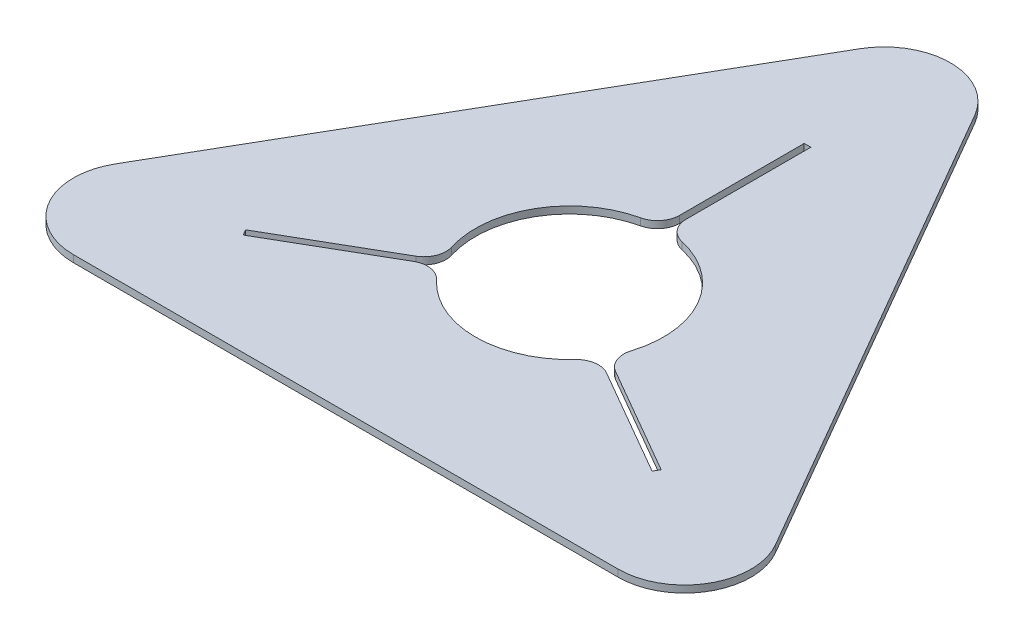
ISO-10303-21;
HEADER;
FILE_DESCRIPTION(('STEP AP214'),'2;1');
FILE_NAME('part.step','',(''),(''),'','','');
FILE_SCHEMA(('AUTOMOTIVE_DESIGN { 1 0 10303 214 1 1 1 1 }'));
ENDSEC;
DATA;
#1=APPLICATION_CONTEXT('core data for automotive mechanical design processes');
#2=APPLICATION_PROTOCOL_DEFINITION('international standard','automotive_design',2000,#1);
#3=PRODUCT_CONTEXT('',#1,'mechanical');
#4=PRODUCT('Part','Part','',(#3));
#5=PRODUCT_RELATED_PRODUCT_CATEGORY('part','',(#4));
#6=PRODUCT_DEFINITION_FORMATION('','',#4);
#7=PRODUCT_DEFINITION_CONTEXT('part definition',#1,'design');
#8=PRODUCT_DEFINITION('design','',#6,#7);
#9=PRODUCT_DEFINITION_SHAPE('','',#8);
#10=(LENGTH_UNIT() NAMED_UNIT(*) SI_UNIT(.MILLI.,.METRE.));
#11=(NAMED_UNIT(*) PLANE_ANGLE_UNIT() SI_UNIT($,.RADIAN.));
#12=(NAMED_UNIT(*) SI_UNIT($,.STERADIAN.) SOLID_ANGLE_UNIT());
#13=UNCERTAINTY_MEASURE_WITH_UNIT(LENGTH_MEASURE(1.E-05),#10,'distance_accuracy_value','');
#14=(GEOMETRIC_REPRESENTATION_CONTEXT(3) GLOBAL_UNCERTAINTY_ASSIGNED_CONTEXT((#13)) GLOBAL_UNIT_ASSIGNED_CONTEXT((#10,
#11,#12)) REPRESENTATION_CONTEXT('',''));
#15=CARTESIAN_POINT('',(0.,0.,0.));
#16=DIRECTION('',(0.,0.,1.));
#17=DIRECTION('',(1.,0.,0.));
#18=AXIS2_PLACEMENT_3D('',#15,#16,#17);
#19=CARTESIAN_POINT('',(0.,0.,404.145188432738));
#20=DIRECTION('',(0.,1.,0.));
#21=DIRECTION('',(0.,0.,1.));
#22=AXIS2_PLACEMENT_3D('',#19,#20,#21);
#23=CYLINDRICAL_SURFACE('',#22,85.);
#24=CARTESIAN_POINT('',(0.,6.35,404.145188432738));
#25=DIRECTION('',(0.,1.,0.));
#26=DIRECTION('',(0.,0.,1.));
#27=AXIS2_PLACEMENT_3D('',#24,#25,#26);
#28=CIRCLE('',#27,85.);
#29=CARTESIAN_POINT('',(81.1339507081753,6.35,429.488472404697));
#30=VERTEX_POINT('',#29);
#31=CARTESIAN_POINT('',(18.6190476190476,6.35,321.209484024084));
#32=VERTEX_POINT('',#31);
#33=EDGE_CURVE('E263',#30,#32,#28,.T.);
#34=ORIENTED_EDGE('',*,*,#33,.T.);
#35=DIRECTION('',(0.,1.,0.));
#36=VECTOR('',#35,1.);
#37=CARTESIAN_POINT('',(18.6190476190476,0.,321.209484024084));
#38=LINE('',#37,#36);
#39=CARTESIAN_POINT('',(18.6190476190476,0.,321.209484024084));
#40=VERTEX_POINT('',#39);
#41=EDGE_CURVE('E353',#32,#40,#38,.F.);
#42=ORIENTED_EDGE('',*,*,#41,.T.);
#43=CARTESIAN_POINT('',(0.,0.,404.145188432738));
#44=DIRECTION('',(0.,1.,0.));
#45=DIRECTION('',(0.,0.,1.));
#46=AXIS2_PLACEMENT_3D('',#43,#44,#45);
#47=CIRCLE('',#46,85.);
#48=CARTESIAN_POINT('',(81.1339507081753,0.,429.488472404697));
#49=VERTEX_POINT('',#48);
#50=EDGE_CURVE('E269',#49,#40,#47,.T.);
#51=ORIENTED_EDGE('',*,*,#50,.F.);
#52=DIRECTION('',(0.,1.,0.));
#53=VECTOR('',#52,1.);
#54=CARTESIAN_POINT('',(81.1339507081753,0.,429.488472404697));
#55=LINE('',#54,#53);
#56=EDGE_CURVE('E350',#49,#30,#55,.T.);
#57=ORIENTED_EDGE('',*,*,#56,.T.);
#58=EDGE_LOOP('',(#34,#42,#51,#57));
#59=FACE_BOUND('',#58,.T.);
#60=ADVANCED_FACE('F33',(#59),#23,.F.);
#61=CARTESIAN_POINT('',(-62.5149030891276,6.35,461.737608869432));
#62=VERTEX_POINT('',#61);
#63=CARTESIAN_POINT('',(62.5149030891277,6.35,461.737608869432));
#64=VERTEX_POINT('',#63);
#65=EDGE_CURVE('E272',#62,#64,#28,.T.);
#66=ORIENTED_EDGE('',*,*,#65,.T.);
#67=DIRECTION('',(0.,1.,0.));
#68=VECTOR('',#67,1.);
#69=CARTESIAN_POINT('',(62.5149030891277,0.,461.737608869432));
#70=LINE('',#69,#68);
#71=CARTESIAN_POINT('',(62.5149030891277,0.,461.737608869432));
#72=VERTEX_POINT('',#71);
#73=EDGE_CURVE('E363',#64,#72,#70,.F.);
#74=ORIENTED_EDGE('',*,*,#73,.T.);
#75=CARTESIAN_POINT('',(-62.5149030891276,0.,461.737608869432));
#76=VERTEX_POINT('',#75);
#77=EDGE_CURVE('E266',#76,#72,#47,.T.);
#78=ORIENTED_EDGE('',*,*,#77,.F.);
#79=DIRECTION('',(0.,1.,0.));
#80=VECTOR('',#79,1.);
#81=CARTESIAN_POINT('',(-62.5149030891276,0.,461.737608869432));
#82=LINE('',#81,#80);
#83=EDGE_CURVE('E360',#76,#62,#82,.T.);
#84=ORIENTED_EDGE('',*,*,#83,.T.);
#85=EDGE_LOOP('',(#66,#74,#78,#84));
#86=FACE_BOUND('',#85,.T.);
#87=ADVANCED_FACE('F380',(#86),#23,.F.);
#88=CARTESIAN_POINT('',(350.,6.35,606.217782649107));
#89=DIRECTION('',(-0.866025403784439,0.,0.5));
#90=DIRECTION('',(0.5,0.,0.866025403784439));
#91=AXIS2_PLACEMENT_3D('',#88,#89,#90);
#92=PLANE('',#91);
#93=DIRECTION('',(-0.5,0.,-0.866025403784439));
#94=VECTOR('',#93,1.);
#95=CARTESIAN_POINT('',(350.,0.,606.217782649107));
#96=LINE('',#95,#94);
#97=CARTESIAN_POINT('',(298.038475772933,0.,516.217782649107));
#98=VERTEX_POINT('',#97);
#99=CARTESIAN_POINT('',(51.9615242270664,0.,90.0000000000002));
#100=VERTEX_POINT('',#99);
#101=EDGE_CURVE('E285',#98,#100,#96,.T.);
#102=ORIENTED_EDGE('',*,*,#101,.T.);
#103=DIRECTION('',(0.,-1.,0.));
#104=VECTOR('',#103,1.);
#105=CARTESIAN_POINT('',(51.9615242270663,6.35,90.));
#106=LINE('',#105,#104);
#107=CARTESIAN_POINT('',(51.9615242270664,6.35,90.0000000000002));
#108=VERTEX_POINT('',#107);
#109=EDGE_CURVE('E306',#100,#108,#106,.F.);
#110=ORIENTED_EDGE('',*,*,#109,.T.);
#111=DIRECTION('',(-0.5,0.,-0.866025403784439));
#112=VECTOR('',#111,1.);
#113=CARTESIAN_POINT('',(350.,6.35,606.217782649107));
#114=LINE('',#113,#112);
#115=CARTESIAN_POINT('',(298.038475772933,6.35,516.217782649107));
#116=VERTEX_POINT('',#115);
#117=EDGE_CURVE('E274',#116,#108,#114,.T.);
#118=ORIENTED_EDGE('',*,*,#117,.F.);
#119=DIRECTION('',(0.,-1.,0.));
#120=VECTOR('',#119,1.);
#121=CARTESIAN_POINT('',(298.038475772933,6.35,516.217782649107));
#122=LINE('',#121,#120);
#123=EDGE_CURVE('E303',#116,#98,#122,.T.);
#124=ORIENTED_EDGE('',*,*,#123,.T.);
#125=EDGE_LOOP('',(#102,#110,#118,#124));
#126=FACE_BOUND('',#125,.T.);
#127=ADVANCED_FACE('F440',(#126),#92,.F.);
#128=CARTESIAN_POINT('',(0.,6.35,0.));
#129=DIRECTION('',(0.866025403784439,0.,0.5));
#130=DIRECTION('',(0.5,0.,-0.866025403784439));
#131=AXIS2_PLACEMENT_3D('',#128,#129,#130);
#132=PLANE('',#131);
#133=DIRECTION('',(-0.5,0.,0.866025403784439));
#134=VECTOR('',#133,1.);
#135=CARTESIAN_POINT('',(0.,6.35,0.));
#136=LINE('',#135,#134);
#137=CARTESIAN_POINT('',(-51.9615242270663,6.35,90.));
#138=VERTEX_POINT('',#137);
#139=CARTESIAN_POINT('',(-298.038475772934,6.35,516.217782649107));
#140=VERTEX_POINT('',#139);
#141=EDGE_CURVE('E277',#138,#140,#136,.T.);
#142=ORIENTED_EDGE('',*,*,#141,.F.);
#143=DIRECTION('',(0.,-1.,0.));
#144=VECTOR('',#143,1.);
#145=CARTESIAN_POINT('',(-51.9615242270663,6.35,90.));
#146=LINE('',#145,#144);
#147=CARTESIAN_POINT('',(-51.9615242270663,0.,90.));
#148=VERTEX_POINT('',#147);
#149=EDGE_CURVE('E294',#138,#148,#146,.T.);
#150=ORIENTED_EDGE('',*,*,#149,.T.);
#151=DIRECTION('',(-0.5,0.,0.866025403784439));
#152=VECTOR('',#151,1.);
#153=CARTESIAN_POINT('',(0.,0.,0.));
#154=LINE('',#153,#152);
#155=CARTESIAN_POINT('',(-298.038475772934,0.,516.217782649107));
#156=VERTEX_POINT('',#155);
#157=EDGE_CURVE('E288',#148,#156,#154,.T.);
#158=ORIENTED_EDGE('',*,*,#157,.T.);
#159=DIRECTION('',(0.,-1.,0.));
#160=VECTOR('',#159,1.);
#161=CARTESIAN_POINT('',(-298.038475772934,6.35,516.217782649107));
#162=LINE('',#161,#160);
#163=EDGE_CURVE('E284',#156,#140,#162,.F.);
#164=ORIENTED_EDGE('',*,*,#163,.T.);
#165=EDGE_LOOP('',(#142,#150,#158,#164));
#166=FACE_BOUND('',#165,.T.);
#167=ADVANCED_FACE('F460',(#166),#132,.F.);
#168=CARTESIAN_POINT('',(-350.,6.35,606.217782649107));
#169=DIRECTION('',(0.,0.,-1.));
#170=DIRECTION('',(-1.,0.,0.));
#171=AXIS2_PLACEMENT_3D('',#168,#169,#170);
#172=PLANE('',#171);
#173=DIRECTION('',(1.,0.,0.));
#174=VECTOR('',#173,1.);
#175=CARTESIAN_POINT('',(-350.,0.,606.217782649107));
#176=LINE('',#175,#174);
#177=CARTESIAN_POINT('',(-246.076951545867,0.,606.217782649107));
#178=VERTEX_POINT('',#177);
#179=CARTESIAN_POINT('',(246.076951545867,0.,606.217782649107));
#180=VERTEX_POINT('',#179);
#181=EDGE_CURVE('E278',#178,#180,#176,.T.);
#182=ORIENTED_EDGE('',*,*,#181,.T.);
#183=DIRECTION('',(0.,-1.,0.));
#184=VECTOR('',#183,1.);
#185=CARTESIAN_POINT('',(246.076951545867,6.35,606.217782649107));
#186=LINE('',#185,#184);
#187=CARTESIAN_POINT('',(246.076951545867,6.35,606.217782649107));
#188=VERTEX_POINT('',#187);
#189=EDGE_CURVE('E317',#180,#188,#186,.F.);
#190=ORIENTED_EDGE('',*,*,#189,.T.);
#191=DIRECTION('',(1.,0.,0.));
#192=VECTOR('',#191,1.);
#193=CARTESIAN_POINT('',(-350.,6.35,606.217782649107));
#194=LINE('',#193,#192);
#195=CARTESIAN_POINT('',(-246.076951545867,6.35,606.217782649107));
#196=VERTEX_POINT('',#195);
#197=EDGE_CURVE('E281',#196,#188,#194,.T.);
#198=ORIENTED_EDGE('',*,*,#197,.F.);
#199=DIRECTION('',(0.,-1.,0.));
#200=VECTOR('',#199,1.);
#201=CARTESIAN_POINT('',(-246.076951545867,6.35,606.217782649107));
#202=LINE('',#201,#200);
#203=EDGE_CURVE('E314',#196,#178,#202,.T.);
#204=ORIENTED_EDGE('',*,*,#203,.T.);
#205=EDGE_LOOP('',(#182,#190,#198,#204));
#206=FACE_BOUND('',#205,.T.);
#207=ADVANCED_FACE('F456',(#206),#172,.F.);
#208=CARTESIAN_POINT('',(0.,6.35,0.));
#209=DIRECTION('',(0.,1.,0.));
#210=DIRECTION('',(0.,0.,1.));
#211=AXIS2_PLACEMENT_3D('',#208,#209,#210);
#212=PLANE('',#211);
#213=CARTESIAN_POINT('',(-18.6190476190476,6.35,321.209484024084));
#214=VERTEX_POINT('',#213);
#215=CARTESIAN_POINT('',(-81.1339507081752,6.35,429.488472404698));
#216=VERTEX_POINT('',#215);
#217=EDGE_CURVE('E273',#214,#216,#28,.T.);
#218=ORIENTED_EDGE('',*,*,#217,.F.);
#219=CARTESIAN_POINT('',(-23.,6.35,301.695200633812));
#220=DIRECTION('',(0.,1.,0.));
#221=DIRECTION('',(0.,0.,1.));
#222=AXIS2_PLACEMENT_3D('',#219,#220,#221);
#223=CIRCLE('',#222,20.);
#224=CARTESIAN_POINT('',(-3.00000000000003,6.35,301.695200633812));
#225=VERTEX_POINT('',#224);
#226=EDGE_CURVE('E335',#214,#225,#223,.T.);
#227=ORIENTED_EDGE('',*,*,#226,.T.);
#228=DIRECTION('',(0.,0.,1.));
#229=VECTOR('',#228,1.);
#230=CARTESIAN_POINT('',(-3.00000000000003,6.35,374.145188432738));
#231=LINE('',#230,#229);
#232=CARTESIAN_POINT('',(-3.00000000000003,6.35,189.145188432738));
#233=VERTEX_POINT('',#232);
#234=EDGE_CURVE('E224',#233,#225,#231,.T.);
#235=ORIENTED_EDGE('',*,*,#234,.F.);
#236=DIRECTION('',(-1.,0.,0.));
#237=VECTOR('',#236,1.);
#238=CARTESIAN_POINT('',(-3.00000000000003,6.35,189.145188432738));
#239=LINE('',#238,#237);
#240=CARTESIAN_POINT('',(2.99999999999997,6.35,189.145188432738));
#241=VERTEX_POINT('',#240);
#242=EDGE_CURVE('E249',#241,#233,#239,.T.);
#243=ORIENTED_EDGE('',*,*,#242,.F.);
#244=DIRECTION('',(0.,0.,-1.));
#245=VECTOR('',#244,1.);
#246=CARTESIAN_POINT('',(3.00000000000002,6.35,374.145188432738));
#247=LINE('',#246,#245);
#248=CARTESIAN_POINT('',(3.,6.35,301.695200633812));
#249=VERTEX_POINT('',#248);
#250=EDGE_CURVE('E257',#249,#241,#247,.T.);
#251=ORIENTED_EDGE('',*,*,#250,.F.);
#252=CARTESIAN_POINT('',(23.,6.35,301.695200633812));
#253=DIRECTION('',(0.,1.,0.));
#254=DIRECTION('',(0.,0.,1.));
#255=AXIS2_PLACEMENT_3D('',#252,#253,#254);
#256=CIRCLE('',#255,20.);
#257=EDGE_CURVE('E333',#249,#32,#256,.T.);
#258=ORIENTED_EDGE('',*,*,#257,.T.);
#259=ORIENTED_EDGE('',*,*,#33,.F.);
#260=CARTESIAN_POINT('',(100.224292051275,6.35,435.451598045158));
#261=DIRECTION('',(0.,1.,0.));
#262=DIRECTION('',(0.,0.,1.));
#263=AXIS2_PLACEMENT_3D('',#260,#261,#262);
#264=CIRCLE('',#263,20.);
#265=CARTESIAN_POINT('',(90.2242920512754,6.35,452.772106120847));
#266=VERTEX_POINT('',#265);
#267=EDGE_CURVE('E331',#30,#266,#264,.T.);
#268=ORIENTED_EDGE('',*,*,#267,.T.);
#269=DIRECTION('',(-0.866025403784439,0.,-0.5));
#270=VECTOR('',#269,1.);
#271=CARTESIAN_POINT('',(27.4807621135332,6.35,416.547112221384));
#272=LINE('',#271,#270);
#273=CARTESIAN_POINT('',(187.695461813654,6.35,509.047112221384));
#274=VERTEX_POINT('',#273);
#275=EDGE_CURVE('E217',#274,#266,#272,.T.);
#276=ORIENTED_EDGE('',*,*,#275,.F.);
#277=DIRECTION('',(0.499999999999995,0.,-0.866025403784442));
#278=VECTOR('',#277,1.);
#279=CARTESIAN_POINT('',(187.695461813654,6.35,509.047112221384));
#280=LINE('',#279,#278);
#281=CARTESIAN_POINT('',(184.695461813654,6.35,514.243264644091));
#282=VERTEX_POINT('',#281);
#283=EDGE_CURVE('E222',#282,#274,#280,.T.);
#284=ORIENTED_EDGE('',*,*,#283,.F.);
#285=DIRECTION('',(0.866025403784439,0.,0.5));
#286=VECTOR('',#285,1.);
#287=CARTESIAN_POINT('',(24.4807621135332,6.35,421.743264644091));
#288=LINE('',#287,#286);
#289=CARTESIAN_POINT('',(87.2242920512754,6.35,457.968258543554));
#290=VERTEX_POINT('',#289);
#291=EDGE_CURVE('E206',#290,#282,#288,.T.);
#292=ORIENTED_EDGE('',*,*,#291,.F.);
#293=CARTESIAN_POINT('',(77.2242920512754,6.35,475.288766619243));
#294=DIRECTION('',(0.,1.,0.));
#295=DIRECTION('',(0.,0.,1.));
#296=AXIS2_PLACEMENT_3D('',#293,#294,#295);
#297=CIRCLE('',#296,20.);
#298=EDGE_CURVE('E329',#290,#64,#297,.T.);
#299=ORIENTED_EDGE('',*,*,#298,.T.);
#300=ORIENTED_EDGE('',*,*,#65,.F.);
#301=CARTESIAN_POINT('',(-77.2242920512753,6.35,475.288766619243));
#302=DIRECTION('',(0.,1.,0.));
#303=DIRECTION('',(0.,0.,1.));
#304=AXIS2_PLACEMENT_3D('',#301,#302,#303);
#305=CIRCLE('',#304,20.);
#306=CARTESIAN_POINT('',(-87.2242920512753,6.35,457.968258543554));
#307=VERTEX_POINT('',#306);
#308=EDGE_CURVE('E327',#62,#307,#305,.T.);
#309=ORIENTED_EDGE('',*,*,#308,.T.);
#310=DIRECTION('',(0.866025403784438,0.,-0.500000000000001));
#311=VECTOR('',#310,1.);
#312=CARTESIAN_POINT('',(-24.4807621135332,6.35,421.743264644091));
#313=LINE('',#312,#311);
#314=CARTESIAN_POINT('',(-184.695461813654,6.35,514.243264644091));
#315=VERTEX_POINT('',#314);
#316=EDGE_CURVE('E236',#315,#307,#313,.T.);
#317=ORIENTED_EDGE('',*,*,#316,.F.);
#318=DIRECTION('',(0.499999999999998,0.,0.866025403784439));
#319=VECTOR('',#318,1.);
#320=CARTESIAN_POINT('',(-184.695461813654,6.35,514.243264644091));
#321=LINE('',#320,#319);
#322=CARTESIAN_POINT('',(-187.695461813654,6.35,509.047112221385));
#323=VERTEX_POINT('',#322);
#324=EDGE_CURVE('E230',#323,#315,#321,.T.);
#325=ORIENTED_EDGE('',*,*,#324,.F.);
#326=DIRECTION('',(-0.866025403784438,0.,0.500000000000001));
#327=VECTOR('',#326,1.);
#328=CARTESIAN_POINT('',(-27.4807621135332,6.35,416.547112221385));
#329=LINE('',#328,#327);
#330=CARTESIAN_POINT('',(-90.2242920512753,6.35,452.772106120847));
#331=VERTEX_POINT('',#330);
#332=EDGE_CURVE('E239',#331,#323,#329,.T.);
#333=ORIENTED_EDGE('',*,*,#332,.F.);
#334=CARTESIAN_POINT('',(-100.224292051275,6.35,435.451598045159));
#335=DIRECTION('',(0.,1.,0.));
#336=DIRECTION('',(0.,0.,1.));
#337=AXIS2_PLACEMENT_3D('',#334,#335,#336);
#338=CIRCLE('',#337,20.);
#339=EDGE_CURVE('E325',#331,#216,#338,.T.);
#340=ORIENTED_EDGE('',*,*,#339,.T.);
#341=EDGE_LOOP('',(#218,#227,#235,#243,#251,#258,#259,#268,#276,#284,#292,#299,#300,#309,#317,
#325,#333,#340));
#342=FACE_BOUND('',#341,.T.);
#343=ORIENTED_EDGE('',*,*,#117,.T.);
#344=CARTESIAN_POINT('',(0.,6.35,120.));
#345=DIRECTION('',(0.,1.,0.));
#346=DIRECTION('',(0.,0.,1.));
#347=AXIS2_PLACEMENT_3D('',#344,#345,#346);
#348=CIRCLE('',#347,60.);
#349=EDGE_CURVE('E312',#108,#138,#348,.T.);
#350=ORIENTED_EDGE('',*,*,#349,.T.);
#351=ORIENTED_EDGE('',*,*,#141,.T.);
#352=CARTESIAN_POINT('',(-246.076951545867,6.35,546.217782649107));
#353=DIRECTION('',(0.,1.,0.));
#354=DIRECTION('',(0.,0.,1.));
#355=AXIS2_PLACEMENT_3D('',#352,#353,#354);
#356=CIRCLE('',#355,60.);
#357=EDGE_CURVE('E308',#140,#196,#356,.T.);
#358=ORIENTED_EDGE('',*,*,#357,.T.);
#359=ORIENTED_EDGE('',*,*,#197,.T.);
#360=CARTESIAN_POINT('',(246.076951545867,6.35,546.217782649107));
#361=DIRECTION('',(0.,1.,0.));
#362=DIRECTION('',(0.,0.,1.));
#363=AXIS2_PLACEMENT_3D('',#360,#361,#362);
#364=CIRCLE('',#363,60.);
#365=EDGE_CURVE('E310',#188,#116,#364,.T.);
#366=ORIENTED_EDGE('',*,*,#365,.T.);
#367=EDGE_LOOP('',(#343,#350,#351,#358,#359,#366));
#368=FACE_BOUND('',#367,.T.);
#369=ADVANCED_FACE('F383',(#342,#368),#212,.T.);
#370=CARTESIAN_POINT('',(0.,0.,0.));
#371=DIRECTION('',(0.,1.,0.));
#372=DIRECTION('',(0.,0.,1.));
#373=AXIS2_PLACEMENT_3D('',#370,#371,#372);
#374=PLANE('',#373);
#375=DIRECTION('',(0.,0.,1.));
#376=VECTOR('',#375,1.);
#377=CARTESIAN_POINT('',(-3.00000000000003,0.,374.145188432738));
#378=LINE('',#377,#376);
#379=CARTESIAN_POINT('',(-3.00000000000003,0.,189.145188432738));
#380=VERTEX_POINT('',#379);
#381=CARTESIAN_POINT('',(-3.00000000000003,0.,301.695200633812));
#382=VERTEX_POINT('',#381);
#383=EDGE_CURVE('E246',#380,#382,#378,.T.);
#384=ORIENTED_EDGE('',*,*,#383,.T.);
#385=CARTESIAN_POINT('',(-23.,0.,301.695200633812));
#386=DIRECTION('',(0.,1.,0.));
#387=DIRECTION('',(0.,0.,1.));
#388=AXIS2_PLACEMENT_3D('',#385,#386,#387);
#389=CIRCLE('',#388,20.);
#390=CARTESIAN_POINT('',(-18.6190476190476,0.,321.209484024084));
#391=VERTEX_POINT('',#390);
#392=EDGE_CURVE('E348',#382,#391,#389,.F.);
#393=ORIENTED_EDGE('',*,*,#392,.T.);
#394=CARTESIAN_POINT('',(-81.1339507081752,0.,429.488472404698));
#395=VERTEX_POINT('',#394);
#396=EDGE_CURVE('E268',#391,#395,#47,.T.);
#397=ORIENTED_EDGE('',*,*,#396,.T.);
#398=CARTESIAN_POINT('',(-100.224292051275,0.,435.451598045159));
#399=DIRECTION('',(0.,1.,0.));
#400=DIRECTION('',(0.,0.,1.));
#401=AXIS2_PLACEMENT_3D('',#398,#399,#400);
#402=CIRCLE('',#401,20.);
#403=CARTESIAN_POINT('',(-90.2242920512753,0.,452.772106120847));
#404=VERTEX_POINT('',#403);
#405=EDGE_CURVE('E339',#395,#404,#402,.F.);
#406=ORIENTED_EDGE('',*,*,#405,.T.);
#407=DIRECTION('',(-0.866025403784438,0.,0.500000000000001));
#408=VECTOR('',#407,1.);
#409=CARTESIAN_POINT('',(-27.4807621135332,0.,416.547112221385));
#410=LINE('',#409,#408);
#411=CARTESIAN_POINT('',(-187.695461813654,0.,509.047112221385));
#412=VERTEX_POINT('',#411);
#413=EDGE_CURVE('E229',#404,#412,#410,.T.);
#414=ORIENTED_EDGE('',*,*,#413,.T.);
#415=DIRECTION('',(0.499999999999998,0.,0.866025403784439));
#416=VECTOR('',#415,1.);
#417=CARTESIAN_POINT('',(-184.695461813654,0.,514.243264644091));
#418=LINE('',#417,#416);
#419=CARTESIAN_POINT('',(-184.695461813654,0.,514.243264644091));
#420=VERTEX_POINT('',#419);
#421=EDGE_CURVE('E232',#412,#420,#418,.T.);
#422=ORIENTED_EDGE('',*,*,#421,.T.);
#423=DIRECTION('',(0.866025403784438,0.,-0.500000000000001));
#424=VECTOR('',#423,1.);
#425=CARTESIAN_POINT('',(-24.4807621135332,0.,421.743264644091));
#426=LINE('',#425,#424);
#427=CARTESIAN_POINT('',(-87.2242920512753,0.,457.968258543554));
#428=VERTEX_POINT('',#427);
#429=EDGE_CURVE('E226',#420,#428,#426,.T.);
#430=ORIENTED_EDGE('',*,*,#429,.T.);
#431=CARTESIAN_POINT('',(-77.2242920512753,0.,475.288766619243));
#432=DIRECTION('',(0.,1.,0.));
#433=DIRECTION('',(0.,0.,1.));
#434=AXIS2_PLACEMENT_3D('',#431,#432,#433);
#435=CIRCLE('',#434,20.);
#436=EDGE_CURVE('E341',#428,#76,#435,.F.);
#437=ORIENTED_EDGE('',*,*,#436,.T.);
#438=ORIENTED_EDGE('',*,*,#77,.T.);
#439=CARTESIAN_POINT('',(77.2242920512754,0.,475.288766619243));
#440=DIRECTION('',(0.,1.,0.));
#441=DIRECTION('',(0.,0.,1.));
#442=AXIS2_PLACEMENT_3D('',#439,#440,#441);
#443=CIRCLE('',#442,20.);
#444=CARTESIAN_POINT('',(87.2242920512754,0.,457.968258543554));
#445=VERTEX_POINT('',#444);
#446=EDGE_CURVE('E48',#72,#445,#443,.F.);
#447=ORIENTED_EDGE('',*,*,#446,.T.);
#448=DIRECTION('',(0.866025403784439,0.,0.5));
#449=VECTOR('',#448,1.);
#450=CARTESIAN_POINT('',(24.4807621135332,0.,421.743264644091));
#451=LINE('',#450,#449);
#452=CARTESIAN_POINT('',(184.695461813654,0.,514.243264644091));
#453=VERTEX_POINT('',#452);
#454=EDGE_CURVE('E191',#445,#453,#451,.T.);
#455=ORIENTED_EDGE('',*,*,#454,.T.);
#456=DIRECTION('',(0.499999999999995,0.,-0.866025403784442));
#457=VECTOR('',#456,1.);
#458=CARTESIAN_POINT('',(187.695461813654,0.,509.047112221384));
#459=LINE('',#458,#457);
#460=CARTESIAN_POINT('',(187.695461813654,0.,509.047112221384));
#461=VERTEX_POINT('',#460);
#462=EDGE_CURVE('E198',#453,#461,#459,.T.);
#463=ORIENTED_EDGE('',*,*,#462,.T.);
#464=DIRECTION('',(-0.866025403784439,0.,-0.5));
#465=VECTOR('',#464,1.);
#466=CARTESIAN_POINT('',(27.4807621135332,0.,416.547112221384));
#467=LINE('',#466,#465);
#468=CARTESIAN_POINT('',(90.2242920512754,0.,452.772106120847));
#469=VERTEX_POINT('',#468);
#470=EDGE_CURVE('E200',#461,#469,#467,.T.);
#471=ORIENTED_EDGE('',*,*,#470,.T.);
#472=CARTESIAN_POINT('',(100.224292051275,0.,435.451598045158));
#473=DIRECTION('',(0.,1.,0.));
#474=DIRECTION('',(0.,0.,1.));
#475=AXIS2_PLACEMENT_3D('',#472,#473,#474);
#476=CIRCLE('',#475,20.);
#477=EDGE_CURVE('E344',#469,#49,#476,.F.);
#478=ORIENTED_EDGE('',*,*,#477,.T.);
#479=ORIENTED_EDGE('',*,*,#50,.T.);
#480=CARTESIAN_POINT('',(23.,0.,301.695200633812));
#481=DIRECTION('',(0.,1.,0.));
#482=DIRECTION('',(0.,0.,1.));
#483=AXIS2_PLACEMENT_3D('',#480,#481,#482);
#484=CIRCLE('',#483,20.);
#485=CARTESIAN_POINT('',(3.,0.,301.695200633812));
#486=VERTEX_POINT('',#485);
#487=EDGE_CURVE('E346',#40,#486,#484,.F.);
#488=ORIENTED_EDGE('',*,*,#487,.T.);
#489=DIRECTION('',(0.,0.,-1.));
#490=VECTOR('',#489,1.);
#491=CARTESIAN_POINT('',(3.00000000000002,0.,374.145188432738));
#492=LINE('',#491,#490);
#493=CARTESIAN_POINT('',(2.99999999999997,0.,189.145188432738));
#494=VERTEX_POINT('',#493);
#495=EDGE_CURVE('E248',#486,#494,#492,.T.);
#496=ORIENTED_EDGE('',*,*,#495,.T.);
#497=DIRECTION('',(-1.,0.,0.));
#498=VECTOR('',#497,1.);
#499=CARTESIAN_POINT('',(-3.00000000000003,0.,189.145188432738));
#500=LINE('',#499,#498);
#501=EDGE_CURVE('E251',#494,#380,#500,.T.);
#502=ORIENTED_EDGE('',*,*,#501,.T.);
#503=EDGE_LOOP('',(#384,#393,#397,#406,#414,#422,#430,#437,#438,#447,#455,#463,#471,#478,#479,
#488,#496,#502));
#504=FACE_BOUND('',#503,.T.);
#505=ORIENTED_EDGE('',*,*,#157,.F.);
#506=CARTESIAN_POINT('',(0.,0.,120.));
#507=DIRECTION('',(0.,1.,0.));
#508=DIRECTION('',(0.,0.,1.));
#509=AXIS2_PLACEMENT_3D('',#506,#507,#508);
#510=CIRCLE('',#509,60.);
#511=EDGE_CURVE('E301',#148,#100,#510,.F.);
#512=ORIENTED_EDGE('',*,*,#511,.T.);
#513=ORIENTED_EDGE('',*,*,#101,.F.);
#514=CARTESIAN_POINT('',(246.076951545867,0.,546.217782649107));
#515=DIRECTION('',(0.,1.,0.));
#516=DIRECTION('',(0.,0.,1.));
#517=AXIS2_PLACEMENT_3D('',#514,#515,#516);
#518=CIRCLE('',#517,60.);
#519=EDGE_CURVE('E299',#98,#180,#518,.F.);
#520=ORIENTED_EDGE('',*,*,#519,.T.);
#521=ORIENTED_EDGE('',*,*,#181,.F.);
#522=CARTESIAN_POINT('',(-246.076951545867,0.,546.217782649107));
#523=DIRECTION('',(0.,1.,0.));
#524=DIRECTION('',(0.,0.,1.));
#525=AXIS2_PLACEMENT_3D('',#522,#523,#524);
#526=CIRCLE('',#525,60.);
#527=EDGE_CURVE('E297',#178,#156,#526,.F.);
#528=ORIENTED_EDGE('',*,*,#527,.T.);
#529=EDGE_LOOP('',(#505,#512,#513,#520,#521,#528));
#530=FACE_BOUND('',#529,.T.);
#531=ADVANCED_FACE('F194',(#504,#530),#374,.F.);
#532=ORIENTED_EDGE('',*,*,#396,.F.);
#533=DIRECTION('',(0.,1.,0.));
#534=VECTOR('',#533,1.);
#535=CARTESIAN_POINT('',(-18.6190476190476,0.,321.209484024084));
#536=LINE('',#535,#534);
#537=EDGE_CURVE('E322',#391,#214,#536,.T.);
#538=ORIENTED_EDGE('',*,*,#537,.T.);
#539=ORIENTED_EDGE('',*,*,#217,.T.);
#540=DIRECTION('',(0.,1.,0.));
#541=VECTOR('',#540,1.);
#542=CARTESIAN_POINT('',(-81.1339507081753,0.,429.488472404698));
#543=LINE('',#542,#541);
#544=EDGE_CURVE('E319',#216,#395,#543,.F.);
#545=ORIENTED_EDGE('',*,*,#544,.T.);
#546=EDGE_LOOP('',(#532,#538,#539,#545));
#547=FACE_BOUND('',#546,.T.);
#548=ADVANCED_FACE('F396',(#547),#23,.F.);
#549=CARTESIAN_POINT('',(0.,6.35,120.));
#550=DIRECTION('',(0.,-1.,0.));
#551=DIRECTION('',(0.,0.,-1.));
#552=AXIS2_PLACEMENT_3D('',#549,#550,#551);
#553=CYLINDRICAL_SURFACE('',#552,60.);
#554=ORIENTED_EDGE('',*,*,#349,.F.);
#555=ORIENTED_EDGE('',*,*,#109,.F.);
#556=ORIENTED_EDGE('',*,*,#511,.F.);
#557=ORIENTED_EDGE('',*,*,#149,.F.);
#558=EDGE_LOOP('',(#554,#555,#556,#557));
#559=FACE_BOUND('',#558,.T.);
#560=ADVANCED_FACE('F444',(#559),#553,.T.);
#561=CARTESIAN_POINT('',(246.076951545867,6.35,546.217782649107));
#562=DIRECTION('',(0.,-1.,0.));
#563=DIRECTION('',(0.,0.,-1.));
#564=AXIS2_PLACEMENT_3D('',#561,#562,#563);
#565=CYLINDRICAL_SURFACE('',#564,60.);
#566=ORIENTED_EDGE('',*,*,#365,.F.);
#567=ORIENTED_EDGE('',*,*,#189,.F.);
#568=ORIENTED_EDGE('',*,*,#519,.F.);
#569=ORIENTED_EDGE('',*,*,#123,.F.);
#570=EDGE_LOOP('',(#566,#567,#568,#569));
#571=FACE_BOUND('',#570,.T.);
#572=ADVANCED_FACE('F449',(#571),#565,.T.);
#573=CARTESIAN_POINT('',(-246.076951545867,6.35,546.217782649107));
#574=DIRECTION('',(0.,-1.,0.));
#575=DIRECTION('',(0.,0.,-1.));
#576=AXIS2_PLACEMENT_3D('',#573,#574,#575);
#577=CYLINDRICAL_SURFACE('',#576,60.);
#578=ORIENTED_EDGE('',*,*,#357,.F.);
#579=ORIENTED_EDGE('',*,*,#163,.F.);
#580=ORIENTED_EDGE('',*,*,#527,.F.);
#581=ORIENTED_EDGE('',*,*,#203,.F.);
#582=EDGE_LOOP('',(#578,#579,#580,#581));
#583=FACE_BOUND('',#582,.T.);
#584=ADVANCED_FACE('F470',(#583),#577,.T.);
#585=CARTESIAN_POINT('',(-3.00000000000003,0.,374.145188432738));
#586=DIRECTION('',(-1.,0.,0.));
#587=DIRECTION('',(0.,0.,1.));
#588=AXIS2_PLACEMENT_3D('',#585,#586,#587);
#589=PLANE('',#588);
#590=ORIENTED_EDGE('',*,*,#234,.T.);
#591=DIRECTION('',(0.,1.,0.));
#592=VECTOR('',#591,1.);
#593=CARTESIAN_POINT('',(-3.00000000000003,0.,301.695200633812));
#594=LINE('',#593,#592);
#595=EDGE_CURVE('E337',#225,#382,#594,.F.);
#596=ORIENTED_EDGE('',*,*,#595,.T.);
#597=ORIENTED_EDGE('',*,*,#383,.F.);
#598=DIRECTION('',(0.,1.,0.));
#599=VECTOR('',#598,1.);
#600=CARTESIAN_POINT('',(-3.00000000000003,0.,189.145188432738));
#601=LINE('',#600,#599);
#602=EDGE_CURVE('E261',#380,#233,#601,.T.);
#603=ORIENTED_EDGE('',*,*,#602,.T.);
#604=EDGE_LOOP('',(#590,#596,#597,#603));
#605=FACE_BOUND('',#604,.T.);
#606=ADVANCED_FACE('F403',(#605),#589,.F.);
#607=CARTESIAN_POINT('',(3.00000000000002,0.,374.145188432738));
#608=DIRECTION('',(1.,0.,0.));
#609=DIRECTION('',(0.,0.,-1.));
#610=AXIS2_PLACEMENT_3D('',#607,#608,#609);
#611=PLANE('',#610);
#612=ORIENTED_EDGE('',*,*,#495,.F.);
#613=DIRECTION('',(0.,1.,0.));
#614=VECTOR('',#613,1.);
#615=CARTESIAN_POINT('',(3.,0.,301.695200633812));
#616=LINE('',#615,#614);
#617=EDGE_CURVE('E356',#486,#249,#616,.T.);
#618=ORIENTED_EDGE('',*,*,#617,.T.);
#619=ORIENTED_EDGE('',*,*,#250,.T.);
#620=DIRECTION('',(0.,1.,0.));
#621=VECTOR('',#620,1.);
#622=CARTESIAN_POINT('',(2.99999999999997,0.,189.145188432738));
#623=LINE('',#622,#621);
#624=EDGE_CURVE('E254',#494,#241,#623,.T.);
#625=ORIENTED_EDGE('',*,*,#624,.F.);
#626=EDGE_LOOP('',(#612,#618,#619,#625));
#627=FACE_BOUND('',#626,.T.);
#628=ADVANCED_FACE('F499',(#627),#611,.F.);
#629=CARTESIAN_POINT('',(-3.00000000000003,0.,189.145188432738));
#630=DIRECTION('',(0.,0.,-1.));
#631=DIRECTION('',(-1.,0.,0.));
#632=AXIS2_PLACEMENT_3D('',#629,#630,#631);
#633=PLANE('',#632);
#634=ORIENTED_EDGE('',*,*,#242,.T.);
#635=ORIENTED_EDGE('',*,*,#602,.F.);
#636=ORIENTED_EDGE('',*,*,#501,.F.);
#637=ORIENTED_EDGE('',*,*,#624,.T.);
#638=EDGE_LOOP('',(#634,#635,#636,#637));
#639=FACE_BOUND('',#638,.T.);
#640=ADVANCED_FACE('F407',(#639),#633,.F.);
#641=CARTESIAN_POINT('',(-24.4807621135332,0.,421.743264644091));
#642=DIRECTION('',(0.500000000000001,0.,0.866025403784438));
#643=DIRECTION('',(0.866025403784438,0.,-0.500000000000001));
#644=AXIS2_PLACEMENT_3D('',#641,#642,#643);
#645=PLANE('',#644);
#646=ORIENTED_EDGE('',*,*,#316,.T.);
#647=DIRECTION('',(0.,1.,0.));
#648=VECTOR('',#647,1.);
#649=CARTESIAN_POINT('',(-87.2242920512753,0.,457.968258543554));
#650=LINE('',#649,#648);
#651=EDGE_CURVE('E41',#307,#428,#650,.F.);
#652=ORIENTED_EDGE('',*,*,#651,.T.);
#653=ORIENTED_EDGE('',*,*,#429,.F.);
#654=DIRECTION('',(0.,1.,0.));
#655=VECTOR('',#654,1.);
#656=CARTESIAN_POINT('',(-184.695461813654,0.,514.243264644091));
#657=LINE('',#656,#655);
#658=EDGE_CURVE('E220',#420,#315,#657,.T.);
#659=ORIENTED_EDGE('',*,*,#658,.T.);
#660=EDGE_LOOP('',(#646,#652,#653,#659));
#661=FACE_BOUND('',#660,.T.);
#662=ADVANCED_FACE('F369',(#661),#645,.F.);
#663=CARTESIAN_POINT('',(-27.4807621135332,0.,416.547112221385));
#664=DIRECTION('',(-0.500000000000001,0.,-0.866025403784438));
#665=DIRECTION('',(-0.866025403784438,0.,0.500000000000001));
#666=AXIS2_PLACEMENT_3D('',#663,#664,#665);
#667=PLANE('',#666);
#668=ORIENTED_EDGE('',*,*,#413,.F.);
#669=DIRECTION('',(0.,1.,0.));
#670=VECTOR('',#669,1.);
#671=CARTESIAN_POINT('',(-90.2242920512753,0.,452.772106120847));
#672=LINE('',#671,#670);
#673=EDGE_CURVE('E11',#404,#331,#672,.T.);
#674=ORIENTED_EDGE('',*,*,#673,.T.);
#675=ORIENTED_EDGE('',*,*,#332,.T.);
#676=DIRECTION('',(0.,1.,0.));
#677=VECTOR('',#676,1.);
#678=CARTESIAN_POINT('',(-187.695461813654,0.,509.047112221385));
#679=LINE('',#678,#677);
#680=EDGE_CURVE('E235',#412,#323,#679,.T.);
#681=ORIENTED_EDGE('',*,*,#680,.F.);
#682=EDGE_LOOP('',(#668,#674,#675,#681));
#683=FACE_BOUND('',#682,.T.);
#684=ADVANCED_FACE('F490',(#683),#667,.F.);
#685=CARTESIAN_POINT('',(-184.695461813654,0.,514.243264644091));
#686=DIRECTION('',(-0.86602540378444,0.,0.499999999999999));
#687=DIRECTION('',(0.499999999999999,0.,0.86602540378444));
#688=AXIS2_PLACEMENT_3D('',#685,#686,#687);
#689=PLANE('',#688);
#690=ORIENTED_EDGE('',*,*,#324,.T.);
#691=ORIENTED_EDGE('',*,*,#658,.F.);
#692=ORIENTED_EDGE('',*,*,#421,.F.);
#693=ORIENTED_EDGE('',*,*,#680,.T.);
#694=EDGE_LOOP('',(#690,#691,#692,#693));
#695=FACE_BOUND('',#694,.T.);
#696=ADVANCED_FACE('F487',(#695),#689,.F.);
#697=CARTESIAN_POINT('',(27.4807621135332,0.,416.547112221384));
#698=DIRECTION('',(0.5,0.,-0.866025403784439));
#699=DIRECTION('',(-0.866025403784439,0.,-0.5));
#700=AXIS2_PLACEMENT_3D('',#697,#698,#699);
#701=PLANE('',#700);
#702=ORIENTED_EDGE('',*,*,#275,.T.);
#703=DIRECTION('',(0.,1.,0.));
#704=VECTOR('',#703,1.);
#705=CARTESIAN_POINT('',(90.2242920512754,0.,452.772106120847));
#706=LINE('',#705,#704);
#707=EDGE_CURVE('E358',#266,#469,#706,.F.);
#708=ORIENTED_EDGE('',*,*,#707,.T.);
#709=ORIENTED_EDGE('',*,*,#470,.F.);
#710=DIRECTION('',(0.,1.,0.));
#711=VECTOR('',#710,1.);
#712=CARTESIAN_POINT('',(187.695461813654,0.,509.047112221384));
#713=LINE('',#712,#711);
#714=EDGE_CURVE('E210',#461,#274,#713,.T.);
#715=ORIENTED_EDGE('',*,*,#714,.T.);
#716=EDGE_LOOP('',(#702,#708,#709,#715));
#717=FACE_BOUND('',#716,.T.);
#718=ADVANCED_FACE('F423',(#717),#701,.F.);
#719=CARTESIAN_POINT('',(24.4807621135332,0.,421.743264644091));
#720=DIRECTION('',(-0.5,0.,0.866025403784439));
#721=DIRECTION('',(0.866025403784439,0.,0.5));
#722=AXIS2_PLACEMENT_3D('',#719,#720,#721);
#723=PLANE('',#722);
#724=ORIENTED_EDGE('',*,*,#454,.F.);
#725=DIRECTION('',(0.,1.,0.));
#726=VECTOR('',#725,1.);
#727=CARTESIAN_POINT('',(87.2242920512754,0.,457.968258543554));
#728=LINE('',#727,#726);
#729=EDGE_CURVE('E365',#445,#290,#728,.T.);
#730=ORIENTED_EDGE('',*,*,#729,.T.);
#731=ORIENTED_EDGE('',*,*,#291,.T.);
#732=DIRECTION('',(0.,1.,0.));
#733=VECTOR('',#732,1.);
#734=CARTESIAN_POINT('',(184.695461813654,0.,514.243264644091));
#735=LINE('',#734,#733);
#736=EDGE_CURVE('E203',#453,#282,#735,.T.);
#737=ORIENTED_EDGE('',*,*,#736,.F.);
#738=EDGE_LOOP('',(#724,#730,#731,#737));
#739=FACE_BOUND('',#738,.T.);
#740=ADVANCED_FACE('F204',(#739),#723,.F.);
#741=CARTESIAN_POINT('',(187.695461813654,0.,509.047112221384));
#742=DIRECTION('',(0.866025403784441,0.,0.499999999999995));
#743=DIRECTION('',(0.499999999999995,0.,-0.866025403784442));
#744=AXIS2_PLACEMENT_3D('',#741,#742,#743);
#745=PLANE('',#744);
#746=ORIENTED_EDGE('',*,*,#283,.T.);
#747=ORIENTED_EDGE('',*,*,#714,.F.);
#748=ORIENTED_EDGE('',*,*,#462,.F.);
#749=ORIENTED_EDGE('',*,*,#736,.T.);
#750=EDGE_LOOP('',(#746,#747,#748,#749));
#751=FACE_BOUND('',#750,.T.);
#752=ADVANCED_FACE('F212',(#751),#745,.F.);
#753=CARTESIAN_POINT('',(-23.,0.,301.695200633812));
#754=DIRECTION('',(0.,1.,0.));
#755=DIRECTION('',(0.,0.,1.));
#756=AXIS2_PLACEMENT_3D('',#753,#754,#755);
#757=CYLINDRICAL_SURFACE('',#756,20.);
#758=ORIENTED_EDGE('',*,*,#392,.F.);
#759=ORIENTED_EDGE('',*,*,#595,.F.);
#760=ORIENTED_EDGE('',*,*,#226,.F.);
#761=ORIENTED_EDGE('',*,*,#537,.F.);
#762=EDGE_LOOP('',(#758,#759,#760,#761));
#763=FACE_BOUND('',#762,.T.);
#764=ADVANCED_FACE('F398',(#763),#757,.T.);
#765=CARTESIAN_POINT('',(23.,0.,301.695200633812));
#766=DIRECTION('',(0.,1.,0.));
#767=DIRECTION('',(0.,0.,1.));
#768=AXIS2_PLACEMENT_3D('',#765,#766,#767);
#769=CYLINDRICAL_SURFACE('',#768,20.);
#770=ORIENTED_EDGE('',*,*,#257,.F.);
#771=ORIENTED_EDGE('',*,*,#617,.F.);
#772=ORIENTED_EDGE('',*,*,#487,.F.);
#773=ORIENTED_EDGE('',*,*,#41,.F.);
#774=EDGE_LOOP('',(#770,#771,#772,#773));
#775=FACE_BOUND('',#774,.T.);
#776=ADVANCED_FACE('F416',(#775),#769,.T.);
#777=CARTESIAN_POINT('',(100.224292051275,0.,435.451598045158));
#778=DIRECTION('',(0.,1.,0.));
#779=DIRECTION('',(0.,0.,1.));
#780=AXIS2_PLACEMENT_3D('',#777,#778,#779);
#781=CYLINDRICAL_SURFACE('',#780,20.);
#782=ORIENTED_EDGE('',*,*,#477,.F.);
#783=ORIENTED_EDGE('',*,*,#707,.F.);
#784=ORIENTED_EDGE('',*,*,#267,.F.);
#785=ORIENTED_EDGE('',*,*,#56,.F.);
#786=EDGE_LOOP('',(#782,#783,#784,#785));
#787=FACE_BOUND('',#786,.T.);
#788=ADVANCED_FACE('F425',(#787),#781,.T.);
#789=CARTESIAN_POINT('',(77.2242920512754,0.,475.288766619243));
#790=DIRECTION('',(0.,1.,0.));
#791=DIRECTION('',(0.,0.,1.));
#792=AXIS2_PLACEMENT_3D('',#789,#790,#791);
#793=CYLINDRICAL_SURFACE('',#792,20.);
#794=ORIENTED_EDGE('',*,*,#298,.F.);
#795=ORIENTED_EDGE('',*,*,#729,.F.);
#796=ORIENTED_EDGE('',*,*,#446,.F.);
#797=ORIENTED_EDGE('',*,*,#73,.F.);
#798=EDGE_LOOP('',(#794,#795,#796,#797));
#799=FACE_BOUND('',#798,.T.);
#800=ADVANCED_FACE('F427',(#799),#793,.T.);
#801=CARTESIAN_POINT('',(-77.2242920512753,0.,475.288766619243));
#802=DIRECTION('',(0.,1.,0.));
#803=DIRECTION('',(0.,0.,1.));
#804=AXIS2_PLACEMENT_3D('',#801,#802,#803);
#805=CYLINDRICAL_SURFACE('',#804,20.);
#806=ORIENTED_EDGE('',*,*,#436,.F.);
#807=ORIENTED_EDGE('',*,*,#651,.F.);
#808=ORIENTED_EDGE('',*,*,#308,.F.);
#809=ORIENTED_EDGE('',*,*,#83,.F.);
#810=EDGE_LOOP('',(#806,#807,#808,#809));
#811=FACE_BOUND('',#810,.T.);
#812=ADVANCED_FACE('F376',(#811),#805,.T.);
#813=CARTESIAN_POINT('',(-100.224292051275,0.,435.451598045159));
#814=DIRECTION('',(0.,1.,0.));
#815=DIRECTION('',(0.,0.,1.));
#816=AXIS2_PLACEMENT_3D('',#813,#814,#815);
#817=CYLINDRICAL_SURFACE('',#816,20.);
#818=ORIENTED_EDGE('',*,*,#339,.F.);
#819=ORIENTED_EDGE('',*,*,#673,.F.);
#820=ORIENTED_EDGE('',*,*,#405,.F.);
#821=ORIENTED_EDGE('',*,*,#544,.F.);
#822=EDGE_LOOP('',(#818,#819,#820,#821));
#823=FACE_BOUND('',#822,.T.);
#824=ADVANCED_FACE('F35',(#823),#817,.T.);
#825=CLOSED_SHELL('',(#60,#87,#127,#167,#207,#369,#531,#548,#560,#572,#584,#606,#628,#640,#662,
#684,#696,#718,#740,#752,#764,#776,#788,#800,#812,#824));
#826=MANIFOLD_SOLID_BREP('B2',#825);
#827=ADVANCED_BREP_SHAPE_REPRESENTATION('',(#18,#826),#14);
#828=SHAPE_DEFINITION_REPRESENTATION(#9,#827);
ENDSEC;
END-ISO-10303-21;
